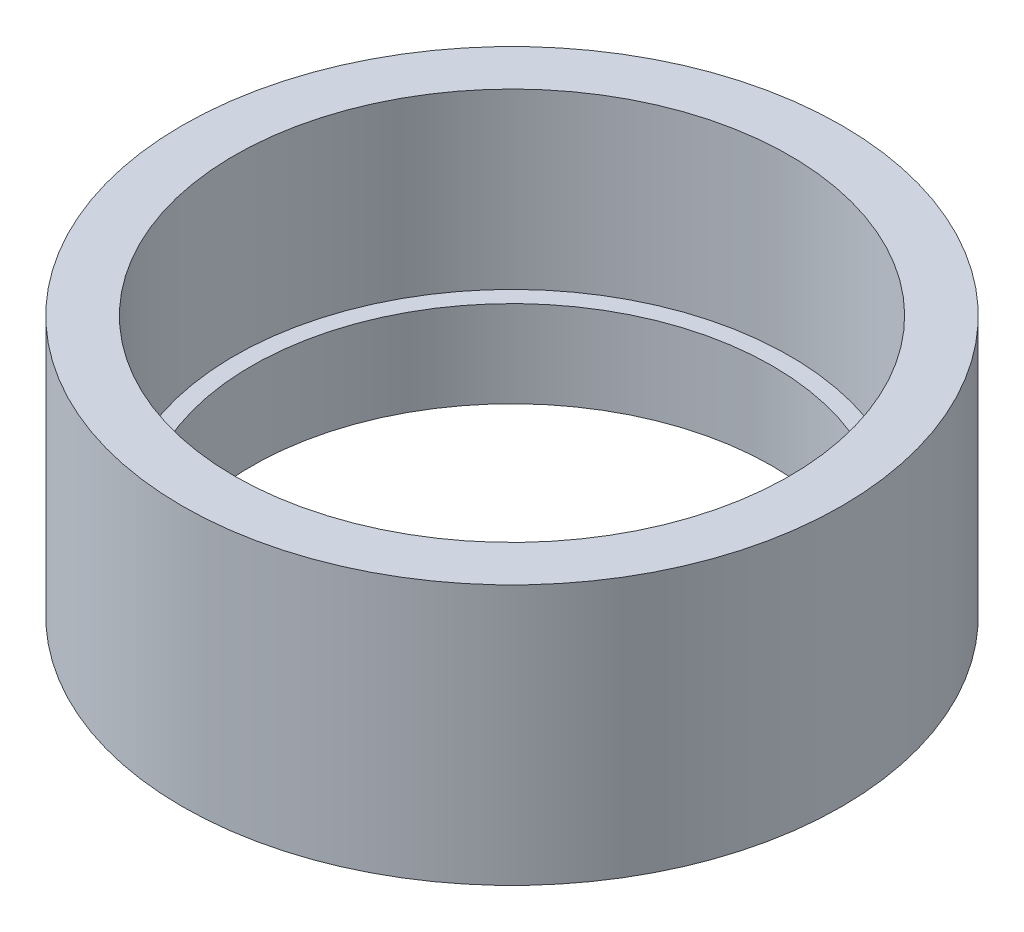
ISO-10303-21;
HEADER;
FILE_DESCRIPTION(('STEP AP214'),'2;1');
FILE_NAME('part.step','',(''),(''),'','','');
FILE_SCHEMA(('AUTOMOTIVE_DESIGN { 1 0 10303 214 1 1 1 1 }'));
ENDSEC;
DATA;
#1=APPLICATION_CONTEXT('core data for automotive mechanical design processes');
#2=APPLICATION_PROTOCOL_DEFINITION('international standard','automotive_design',2000,#1);
#3=PRODUCT_CONTEXT('',#1,'mechanical');
#4=PRODUCT('Part','Part','',(#3));
#5=PRODUCT_RELATED_PRODUCT_CATEGORY('part','',(#4));
#6=PRODUCT_DEFINITION_FORMATION('','',#4);
#7=PRODUCT_DEFINITION_CONTEXT('part definition',#1,'design');
#8=PRODUCT_DEFINITION('design','',#6,#7);
#9=PRODUCT_DEFINITION_SHAPE('','',#8);
#10=(LENGTH_UNIT() NAMED_UNIT(*) SI_UNIT(.MILLI.,.METRE.));
#11=(NAMED_UNIT(*) PLANE_ANGLE_UNIT() SI_UNIT($,.RADIAN.));
#12=(NAMED_UNIT(*) SI_UNIT($,.STERADIAN.) SOLID_ANGLE_UNIT());
#13=UNCERTAINTY_MEASURE_WITH_UNIT(LENGTH_MEASURE(1.E-05),#10,'distance_accuracy_value','');
#14=(GEOMETRIC_REPRESENTATION_CONTEXT(3) GLOBAL_UNCERTAINTY_ASSIGNED_CONTEXT((#13)) GLOBAL_UNIT_ASSIGNED_CONTEXT((#10,
#11,#12)) REPRESENTATION_CONTEXT('',''));
#15=CARTESIAN_POINT('',(0.,0.,0.));
#16=DIRECTION('',(0.,0.,1.));
#17=DIRECTION('',(1.,0.,0.));
#18=AXIS2_PLACEMENT_3D('',#15,#16,#17);
#19=CARTESIAN_POINT('',(0.,1.,0.));
#20=DIRECTION('',(0.,1.,0.));
#21=DIRECTION('',(0.,0.,1.));
#22=AXIS2_PLACEMENT_3D('',#19,#20,#21);
#23=PLANE('',#22);
#24=CARTESIAN_POINT('',(0.,1.,0.));
#25=DIRECTION('',(0.,1.,0.));
#26=DIRECTION('',(0.,0.,1.));
#27=AXIS2_PLACEMENT_3D('',#24,#25,#26);
#28=CIRCLE('',#27,3.);
#29=CARTESIAN_POINT('',(0.,1.,3.));
#30=VERTEX_POINT('',#29);
#31=EDGE_CURVE('E42',#30,#30,#28,.T.);
#32=ORIENTED_EDGE('',*,*,#31,.F.);
#33=EDGE_LOOP('',(#32));
#34=FACE_BOUND('',#33,.T.);
#35=CARTESIAN_POINT('',(0.,1.,0.));
#36=DIRECTION('',(0.,1.,0.));
#37=DIRECTION('',(0.,0.,1.));
#38=AXIS2_PLACEMENT_3D('',#35,#36,#37);
#39=CIRCLE('',#38,3.2);
#40=CARTESIAN_POINT('',(0.,1.,3.2));
#41=VERTEX_POINT('',#40);
#42=EDGE_CURVE('E10',#41,#41,#39,.F.);
#43=ORIENTED_EDGE('',*,*,#42,.F.);
#44=EDGE_LOOP('',(#43));
#45=FACE_BOUND('',#44,.T.);
#46=ADVANCED_FACE('F31',(#34,#45),#23,.T.);
#47=CARTESIAN_POINT('',(0.,0.,0.));
#48=DIRECTION('',(0.,1.,0.));
#49=DIRECTION('',(0.,0.,1.));
#50=AXIS2_PLACEMENT_3D('',#47,#48,#49);
#51=PLANE('',#50);
#52=CARTESIAN_POINT('',(0.,0.,0.));
#53=DIRECTION('',(0.,1.,0.));
#54=DIRECTION('',(0.,0.,1.));
#55=AXIS2_PLACEMENT_3D('',#52,#53,#54);
#56=CIRCLE('',#55,3.8);
#57=CARTESIAN_POINT('',(0.,0.,3.8));
#58=VERTEX_POINT('',#57);
#59=EDGE_CURVE('E38',#58,#58,#56,.T.);
#60=ORIENTED_EDGE('',*,*,#59,.F.);
#61=EDGE_LOOP('',(#60));
#62=FACE_BOUND('',#61,.T.);
#63=CARTESIAN_POINT('',(0.,0.,0.));
#64=DIRECTION('',(0.,1.,0.));
#65=DIRECTION('',(0.,0.,1.));
#66=AXIS2_PLACEMENT_3D('',#63,#64,#65);
#67=CIRCLE('',#66,3.);
#68=CARTESIAN_POINT('',(0.,0.,3.));
#69=VERTEX_POINT('',#68);
#70=EDGE_CURVE('E46',#69,#69,#67,.T.);
#71=ORIENTED_EDGE('',*,*,#70,.T.);
#72=EDGE_LOOP('',(#71));
#73=FACE_BOUND('',#72,.T.);
#74=ADVANCED_FACE('F73',(#62,#73),#51,.F.);
#75=CARTESIAN_POINT('',(0.,1.,0.));
#76=DIRECTION('',(0.,-1.,0.));
#77=DIRECTION('',(0.,0.,-1.));
#78=AXIS2_PLACEMENT_3D('',#75,#76,#77);
#79=CYLINDRICAL_SURFACE('',#78,3.8);
#80=ORIENTED_EDGE('',*,*,#59,.T.);
#81=EDGE_LOOP('',(#80));
#82=FACE_BOUND('',#81,.T.);
#83=CARTESIAN_POINT('',(0.,3.,0.));
#84=DIRECTION('',(0.,1.,0.));
#85=DIRECTION('',(0.,0.,1.));
#86=AXIS2_PLACEMENT_3D('',#83,#84,#85);
#87=CIRCLE('',#86,3.8);
#88=CARTESIAN_POINT('',(0.,3.,3.8));
#89=VERTEX_POINT('',#88);
#90=EDGE_CURVE('E50',#89,#89,#87,.T.);
#91=ORIENTED_EDGE('',*,*,#90,.F.);
#92=EDGE_LOOP('',(#91));
#93=FACE_BOUND('',#92,.T.);
#94=ADVANCED_FACE('F33',(#82,#93),#79,.T.);
#95=CARTESIAN_POINT('',(0.,1.,0.));
#96=DIRECTION('',(0.,-1.,0.));
#97=DIRECTION('',(0.,0.,-1.));
#98=AXIS2_PLACEMENT_3D('',#95,#96,#97);
#99=CYLINDRICAL_SURFACE('',#98,3.);
#100=ORIENTED_EDGE('',*,*,#31,.T.);
#101=EDGE_LOOP('',(#100));
#102=FACE_BOUND('',#101,.T.);
#103=ORIENTED_EDGE('',*,*,#70,.F.);
#104=EDGE_LOOP('',(#103));
#105=FACE_BOUND('',#104,.T.);
#106=ADVANCED_FACE('F62',(#102,#105),#99,.F.);
#107=CARTESIAN_POINT('',(0.,3.,0.));
#108=DIRECTION('',(0.,1.,0.));
#109=DIRECTION('',(0.,0.,1.));
#110=AXIS2_PLACEMENT_3D('',#107,#108,#109);
#111=PLANE('',#110);
#112=ORIENTED_EDGE('',*,*,#90,.T.);
#113=EDGE_LOOP('',(#112));
#114=FACE_BOUND('',#113,.T.);
#115=CARTESIAN_POINT('',(0.,3.,0.));
#116=DIRECTION('',(0.,1.,0.));
#117=DIRECTION('',(0.,0.,1.));
#118=AXIS2_PLACEMENT_3D('',#115,#116,#117);
#119=CIRCLE('',#118,3.2);
#120=CARTESIAN_POINT('',(0.,3.,3.2));
#121=VERTEX_POINT('',#120);
#122=EDGE_CURVE('E54',#121,#121,#119,.T.);
#123=ORIENTED_EDGE('',*,*,#122,.F.);
#124=EDGE_LOOP('',(#123));
#125=FACE_BOUND('',#124,.T.);
#126=ADVANCED_FACE('F60',(#114,#125),#111,.T.);
#127=CARTESIAN_POINT('',(0.,3.,0.));
#128=DIRECTION('',(0.,-1.,0.));
#129=DIRECTION('',(0.,0.,-1.));
#130=AXIS2_PLACEMENT_3D('',#127,#128,#129);
#131=CYLINDRICAL_SURFACE('',#130,3.2);
#132=ORIENTED_EDGE('',*,*,#122,.T.);
#133=EDGE_LOOP('',(#132));
#134=FACE_BOUND('',#133,.T.);
#135=ORIENTED_EDGE('',*,*,#42,.T.);
#136=EDGE_LOOP('',(#135));
#137=FACE_BOUND('',#136,.T.);
#138=ADVANCED_FACE('F58',(#134,#137),#131,.F.);
#139=CLOSED_SHELL('',(#46,#74,#94,#106,#126,#138));
#140=MANIFOLD_SOLID_BREP('B2',#139);
#141=ADVANCED_BREP_SHAPE_REPRESENTATION('',(#18,#140),#14);
#142=SHAPE_DEFINITION_REPRESENTATION(#9,#141);
ENDSEC;
END-ISO-10303-21;
